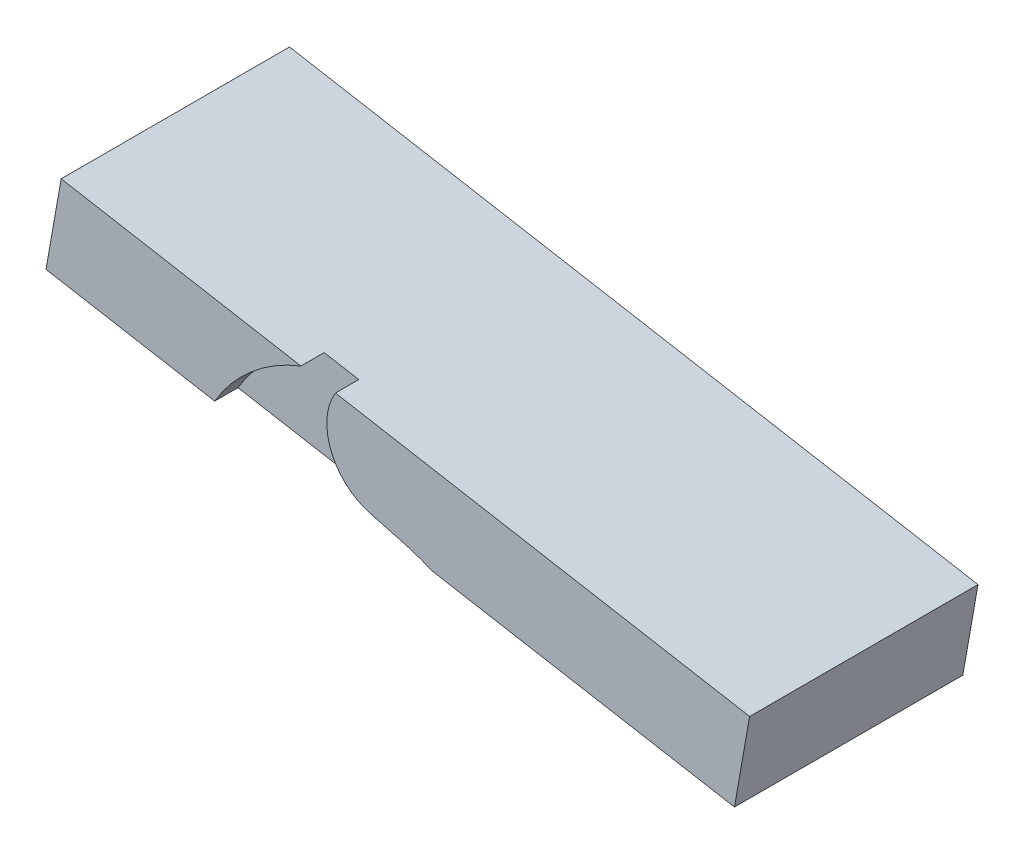
ISO-10303-21;
HEADER;
FILE_DESCRIPTION(('STEP AP214'),'2;1');
FILE_NAME('part.step','',(''),(''),'','','');
FILE_SCHEMA(('AUTOMOTIVE_DESIGN { 1 0 10303 214 1 1 1 1 }'));
ENDSEC;
DATA;
#1=APPLICATION_CONTEXT('core data for automotive mechanical design processes');
#2=APPLICATION_PROTOCOL_DEFINITION('international standard','automotive_design',2000,#1);
#3=PRODUCT_CONTEXT('',#1,'mechanical');
#4=PRODUCT('Part','Part','',(#3));
#5=PRODUCT_RELATED_PRODUCT_CATEGORY('part','',(#4));
#6=PRODUCT_DEFINITION_FORMATION('','',#4);
#7=PRODUCT_DEFINITION_CONTEXT('part definition',#1,'design');
#8=PRODUCT_DEFINITION('design','',#6,#7);
#9=PRODUCT_DEFINITION_SHAPE('','',#8);
#10=(LENGTH_UNIT() NAMED_UNIT(*) SI_UNIT(.MILLI.,.METRE.));
#11=(NAMED_UNIT(*) PLANE_ANGLE_UNIT() SI_UNIT($,.RADIAN.));
#12=(NAMED_UNIT(*) SI_UNIT($,.STERADIAN.) SOLID_ANGLE_UNIT());
#13=UNCERTAINTY_MEASURE_WITH_UNIT(LENGTH_MEASURE(1.E-05),#10,'distance_accuracy_value','');
#14=(GEOMETRIC_REPRESENTATION_CONTEXT(3) GLOBAL_UNCERTAINTY_ASSIGNED_CONTEXT((#13)) GLOBAL_UNIT_ASSIGNED_CONTEXT((#10,
#11,#12)) REPRESENTATION_CONTEXT('',''));
#15=CARTESIAN_POINT('',(0.,0.,0.));
#16=DIRECTION('',(0.,0.,1.));
#17=DIRECTION('',(1.,0.,0.));
#18=AXIS2_PLACEMENT_3D('',#15,#16,#17);
#19=CARTESIAN_POINT('',(0.,0.,-3.048));
#20=DIRECTION('',(0.,0.,1.));
#21=DIRECTION('',(1.,0.,0.));
#22=AXIS2_PLACEMENT_3D('',#19,#20,#21);
#23=PLANE('',#22);
#24=CARTESIAN_POINT('',(-2.48342826754325,-11.827752618226,-3.048));
#25=DIRECTION('',(0.,0.,1.));
#26=DIRECTION('',(1.,0.,0.));
#27=AXIS2_PLACEMENT_3D('',#24,#25,#26);
#28=CIRCLE('',#27,38.6647254004982);
#29=CARTESIAN_POINT('',(13.3811149594307,23.4323843425886,-3.048));
#30=VERTEX_POINT('',#29);
#31=CARTESIAN_POINT('',(7.52373903976478,25.5195042124902,-3.048));
#32=VERTEX_POINT('',#31);
#33=EDGE_CURVE('E213',#30,#32,#28,.T.);
#34=ORIENTED_EDGE('',*,*,#33,.T.);
#35=DIRECTION('',(0.965925826289069,-0.258819045102518,0.));
#36=VECTOR('',#35,1.);
#37=CARTESIAN_POINT('',(6.88387100306433,25.6909563361866,-3.048));
#38=LINE('',#37,#36);
#39=CARTESIAN_POINT('',(0.,27.5354840122576,-3.048));
#40=VERTEX_POINT('',#39);
#41=EDGE_CURVE('E211',#40,#32,#38,.T.);
#42=ORIENTED_EDGE('',*,*,#41,.F.);
#43=CARTESIAN_POINT('',(3.28700187280198,39.8027420061288,-3.048));
#44=DIRECTION('',(0.,0.,1.));
#45=DIRECTION('',(1.,0.,0.));
#46=AXIS2_PLACEMENT_3D('',#43,#44,#45);
#47=CIRCLE('',#46,12.7);
#48=CARTESIAN_POINT('',(-7.52655420820017,46.462847476992,-3.048));
#49=VERTEX_POINT('',#48);
#50=EDGE_CURVE('E208',#49,#40,#47,.T.);
#51=ORIENTED_EDGE('',*,*,#50,.F.);
#52=DIRECTION('',(0.984807753012207,-0.173648177666934,0.));
#53=VECTOR('',#52,1.);
#54=CARTESIAN_POINT('',(7.71866149729522,43.7747046213926,-3.048));
#55=LINE('',#54,#53);
#56=CARTESIAN_POINT('',(-15.0577360385898,47.7907980303111,-3.048));
#57=VERTEX_POINT('',#56);
#58=EDGE_CURVE('E183',#57,#49,#55,.T.);
#59=ORIENTED_EDGE('',*,*,#58,.F.);
#60=CARTESIAN_POINT('',(-1.24139416120389,12.5408173038956,-3.048));
#61=DIRECTION('',(0.,0.,1.));
#62=DIRECTION('',(1.,0.,0.));
#63=AXIS2_PLACEMENT_3D('',#60,#61,#62);
#64=CIRCLE('',#63,37.8609620068675);
#65=CARTESIAN_POINT('',(-33.8602061938296,31.7623038662221,-3.048));
#66=VERTEX_POINT('',#65);
#67=EDGE_CURVE('E41',#57,#66,#64,.T.);
#68=ORIENTED_EDGE('',*,*,#67,.T.);
#69=DIRECTION('',(-0.984807753012207,0.173648177666934,0.));
#70=VECTOR('',#69,1.);
#71=CARTESIAN_POINT('',(4.41066371274012,25.0141169265101,-3.048));
#72=LINE('',#71,#70);
#73=EDGE_CURVE('E188',#30,#66,#72,.T.);
#74=ORIENTED_EDGE('',*,*,#73,.F.);
#75=EDGE_LOOP('',(#34,#42,#51,#59,#68,#74));
#76=FACE_BOUND('',#75,.T.);
#77=ADVANCED_FACE('F37',(#76),#23,.T.);
#78=CARTESIAN_POINT('',(-2.48342826754325,-11.827752618226,3.048));
#79=DIRECTION('',(0.,0.,-1.));
#80=DIRECTION('',(-1.,0.,0.));
#81=AXIS2_PLACEMENT_3D('',#78,#79,#80);
#82=CYLINDRICAL_SURFACE('',#81,38.6647254004982);
#83=CARTESIAN_POINT('',(-2.48342826754325,-11.827752618226,2.032));
#84=DIRECTION('',(0.,0.,1.));
#85=DIRECTION('',(1.,0.,0.));
#86=AXIS2_PLACEMENT_3D('',#83,#84,#85);
#87=CIRCLE('',#86,38.6647254004982);
#88=CARTESIAN_POINT('',(13.3811149594308,23.4323843425886,2.032));
#89=VERTEX_POINT('',#88);
#90=CARTESIAN_POINT('',(7.52373903976478,25.5195042124902,2.032));
#91=VERTEX_POINT('',#90);
#92=EDGE_CURVE('E198',#89,#91,#87,.T.);
#93=ORIENTED_EDGE('',*,*,#92,.T.);
#94=DIRECTION('',(0.,0.,-1.));
#95=VECTOR('',#94,1.);
#96=CARTESIAN_POINT('',(7.52373903976478,25.5195042124902,3.048));
#97=LINE('',#96,#95);
#98=EDGE_CURVE('E202',#91,#32,#97,.T.);
#99=ORIENTED_EDGE('',*,*,#98,.T.);
#100=ORIENTED_EDGE('',*,*,#33,.F.);
#101=DIRECTION('',(0.,0.,-1.));
#102=VECTOR('',#101,1.);
#103=CARTESIAN_POINT('',(13.3811149594308,23.4323843425886,3.048));
#104=LINE('',#103,#102);
#105=EDGE_CURVE('E74',#89,#30,#104,.T.);
#106=ORIENTED_EDGE('',*,*,#105,.F.);
#107=EDGE_LOOP('',(#93,#99,#100,#106));
#108=FACE_BOUND('',#107,.T.);
#109=ADVANCED_FACE('F140',(#108),#82,.F.);
#110=CARTESIAN_POINT('',(-1.24139416120389,12.5408173038956,3.048));
#111=DIRECTION('',(0.,0.,-1.));
#112=DIRECTION('',(-1.,0.,0.));
#113=AXIS2_PLACEMENT_3D('',#110,#111,#112);
#114=CYLINDRICAL_SURFACE('',#113,37.8609620068675);
#115=ORIENTED_EDGE('',*,*,#67,.F.);
#116=DIRECTION('',(0.,0.,-1.));
#117=VECTOR('',#116,1.);
#118=CARTESIAN_POINT('',(-15.0577360385898,47.7907980303111,3.048));
#119=LINE('',#118,#117);
#120=CARTESIAN_POINT('',(-15.0577360385898,47.7907980303111,2.032));
#121=VERTEX_POINT('',#120);
#122=EDGE_CURVE('E230',#121,#57,#119,.T.);
#123=ORIENTED_EDGE('',*,*,#122,.F.);
#124=CARTESIAN_POINT('',(-1.24139416120389,12.5408173038956,2.032));
#125=DIRECTION('',(0.,0.,1.));
#126=DIRECTION('',(1.,0.,0.));
#127=AXIS2_PLACEMENT_3D('',#124,#125,#126);
#128=CIRCLE('',#127,37.8609620068675);
#129=CARTESIAN_POINT('',(-33.8602061938296,31.7623038662221,2.032));
#130=VERTEX_POINT('',#129);
#131=EDGE_CURVE('E194',#121,#130,#128,.T.);
#132=ORIENTED_EDGE('',*,*,#131,.T.);
#133=DIRECTION('',(0.,0.,-1.));
#134=VECTOR('',#133,1.);
#135=CARTESIAN_POINT('',(-33.8602061938296,31.7623038662221,3.048));
#136=LINE('',#135,#134);
#137=EDGE_CURVE('E197',#66,#130,#136,.F.);
#138=ORIENTED_EDGE('',*,*,#137,.F.);
#139=EDGE_LOOP('',(#115,#123,#132,#138));
#140=FACE_BOUND('',#139,.T.);
#141=ADVANCED_FACE('F146',(#140),#114,.F.);
#142=CARTESIAN_POINT('',(3.28700187280198,39.8027420061288,3.048));
#143=DIRECTION('',(0.,0.,-1.));
#144=DIRECTION('',(-1.,0.,0.));
#145=AXIS2_PLACEMENT_3D('',#142,#143,#144);
#146=CYLINDRICAL_SURFACE('',#145,12.7);
#147=DIRECTION('',(0.,0.,-1.));
#148=VECTOR('',#147,1.);
#149=CARTESIAN_POINT('',(-7.52655420820017,46.462847476992,3.048));
#150=LINE('',#149,#148);
#151=CARTESIAN_POINT('',(-7.52655420820017,46.462847476992,2.032));
#152=VERTEX_POINT('',#151);
#153=EDGE_CURVE('E200',#152,#49,#150,.T.);
#154=ORIENTED_EDGE('',*,*,#153,.T.);
#155=ORIENTED_EDGE('',*,*,#50,.T.);
#156=DIRECTION('',(0.,0.,-1.));
#157=VECTOR('',#156,1.);
#158=CARTESIAN_POINT('',(0.,27.5354840122576,3.048));
#159=LINE('',#158,#157);
#160=CARTESIAN_POINT('',(0.,27.5354840122576,2.032));
#161=VERTEX_POINT('',#160);
#162=EDGE_CURVE('E205',#161,#40,#159,.T.);
#163=ORIENTED_EDGE('',*,*,#162,.F.);
#164=CARTESIAN_POINT('',(3.28700187280198,39.8027420061288,2.032));
#165=DIRECTION('',(0.,0.,1.));
#166=DIRECTION('',(1.,0.,0.));
#167=AXIS2_PLACEMENT_3D('',#164,#165,#166);
#168=CIRCLE('',#167,12.7);
#169=EDGE_CURVE('E82',#152,#161,#168,.T.);
#170=ORIENTED_EDGE('',*,*,#169,.F.);
#171=EDGE_LOOP('',(#154,#155,#163,#170));
#172=FACE_BOUND('',#171,.T.);
#173=ADVANCED_FACE('F150',(#172),#146,.T.);
#174=CARTESIAN_POINT('',(6.88387100306433,25.6909563361866,3.048));
#175=DIRECTION('',(0.258819045102518,0.965925826289069,0.));
#176=DIRECTION('',(-0.965925826289069,0.258819045102518,0.));
#177=AXIS2_PLACEMENT_3D('',#174,#175,#176);
#178=PLANE('',#177);
#179=ORIENTED_EDGE('',*,*,#162,.T.);
#180=ORIENTED_EDGE('',*,*,#41,.T.);
#181=ORIENTED_EDGE('',*,*,#98,.F.);
#182=DIRECTION('',(0.965925826289069,-0.258819045102518,0.));
#183=VECTOR('',#182,1.);
#184=CARTESIAN_POINT('',(6.88387100306433,25.6909563361866,2.032));
#185=LINE('',#184,#183);
#186=EDGE_CURVE('E189',#161,#91,#185,.T.);
#187=ORIENTED_EDGE('',*,*,#186,.F.);
#188=EDGE_LOOP('',(#179,#180,#181,#187));
#189=FACE_BOUND('',#188,.T.);
#190=ADVANCED_FACE('F153',(#189),#178,.F.);
#191=CARTESIAN_POINT('',(-70.6316870667901,38.2461080647304,162.968548839141));
#192=DIRECTION('',(0.984807753012207,-0.173648177666934,0.));
#193=DIRECTION('',(0.173648177666934,0.984807753012207,0.));
#194=AXIS2_PLACEMENT_3D('',#191,#192,#193);
#195=PLANE('',#194);
#196=DIRECTION('',(-0.173648177666934,-0.984807753012207,0.));
#197=VECTOR('',#196,1.);
#198=CARTESIAN_POINT('',(-70.6316870667901,38.2461080647304,2.03200000000001));
#199=LINE('',#198,#197);
#200=CARTESIAN_POINT('',(-67.323689282235,57.006695759613,2.03200000000001));
#201=VERTEX_POINT('',#200);
#202=CARTESIAN_POINT('',(-70.6316870667901,38.2461080647304,2.03200000000001));
#203=VERTEX_POINT('',#202);
#204=EDGE_CURVE('E171',#201,#203,#199,.T.);
#205=ORIENTED_EDGE('',*,*,#204,.F.);
#206=DIRECTION('',(0.,0.,-1.));
#207=VECTOR('',#206,1.);
#208=CARTESIAN_POINT('',(-67.323689282235,57.006695759613,162.968548839141));
#209=LINE('',#208,#207);
#210=CARTESIAN_POINT('',(-67.323689282235,57.006695759613,-47.752));
#211=VERTEX_POINT('',#210);
#212=EDGE_CURVE('E172',#201,#211,#209,.T.);
#213=ORIENTED_EDGE('',*,*,#212,.T.);
#214=DIRECTION('',(0.173648177666934,0.984807753012207,0.));
#215=VECTOR('',#214,1.);
#216=CARTESIAN_POINT('',(-70.6316870667901,38.2461080647304,-47.752));
#217=LINE('',#216,#215);
#218=CARTESIAN_POINT('',(-70.6316870667901,38.2461080647304,-47.752));
#219=VERTEX_POINT('',#218);
#220=EDGE_CURVE('E122',#219,#211,#217,.T.);
#221=ORIENTED_EDGE('',*,*,#220,.F.);
#222=DIRECTION('',(0.,0.,-1.));
#223=VECTOR('',#222,1.);
#224=CARTESIAN_POINT('',(-70.6316870667901,38.2461080647304,162.968548839141));
#225=LINE('',#224,#223);
#226=EDGE_CURVE('E173',#203,#219,#225,.T.);
#227=ORIENTED_EDGE('',*,*,#226,.F.);
#228=EDGE_LOOP('',(#205,#213,#221,#227));
#229=FACE_BOUND('',#228,.T.);
#230=ADVANCED_FACE('F136',(#229),#195,.F.);
#231=CARTESIAN_POINT('',(0.,0.,-47.752));
#232=DIRECTION('',(0.,0.,1.));
#233=DIRECTION('',(1.,0.,0.));
#234=AXIS2_PLACEMENT_3D('',#231,#232,#233);
#235=PLANE('',#234);
#236=ORIENTED_EDGE('',*,*,#220,.T.);
#237=DIRECTION('',(0.984807753012207,-0.173648177666934,0.));
#238=VECTOR('',#237,1.);
#239=CARTESIAN_POINT('',(-67.323689282235,57.006695759613,-47.752));
#240=LINE('',#239,#238);
#241=CARTESIAN_POINT('',(82.7610122768254,30.5427134831723,-47.752));
#242=VERTEX_POINT('',#241);
#243=EDGE_CURVE('E47',#211,#242,#240,.T.);
#244=ORIENTED_EDGE('',*,*,#243,.T.);
#245=DIRECTION('',(-0.173648177666933,-0.984807753012208,0.));
#246=VECTOR('',#245,1.);
#247=CARTESIAN_POINT('',(79.4530144922704,11.7821257882897,-47.752));
#248=LINE('',#247,#246);
#249=CARTESIAN_POINT('',(79.4530144922704,11.7821257882897,-47.752));
#250=VERTEX_POINT('',#249);
#251=EDGE_CURVE('E11',#242,#250,#248,.T.);
#252=ORIENTED_EDGE('',*,*,#251,.T.);
#253=DIRECTION('',(-0.984807753012207,0.173648177666934,0.));
#254=VECTOR('',#253,1.);
#255=CARTESIAN_POINT('',(-70.6316870667901,38.2461080647304,-47.752));
#256=LINE('',#255,#254);
#257=EDGE_CURVE('E184',#250,#219,#256,.T.);
#258=ORIENTED_EDGE('',*,*,#257,.T.);
#259=EDGE_LOOP('',(#236,#244,#252,#258));
#260=FACE_BOUND('',#259,.T.);
#261=ADVANCED_FACE('F118',(#260),#235,.F.);
#262=CARTESIAN_POINT('',(79.4530144922704,11.7821257882897,162.968548839141));
#263=DIRECTION('',(-0.984807753012208,0.173648177666933,0.));
#264=DIRECTION('',(-0.173648177666933,-0.984807753012208,0.));
#265=AXIS2_PLACEMENT_3D('',#262,#263,#264);
#266=PLANE('',#265);
#267=DIRECTION('',(0.173648177666933,0.984807753012208,0.));
#268=VECTOR('',#267,1.);
#269=CARTESIAN_POINT('',(79.4530144922704,11.7821257882897,2.03200000000001));
#270=LINE('',#269,#268);
#271=CARTESIAN_POINT('',(79.4530144922704,11.7821257882897,2.03200000000001));
#272=VERTEX_POINT('',#271);
#273=CARTESIAN_POINT('',(82.7610122768254,30.5427134831723,2.03200000000001));
#274=VERTEX_POINT('',#273);
#275=EDGE_CURVE('E125',#272,#274,#270,.T.);
#276=ORIENTED_EDGE('',*,*,#275,.F.);
#277=DIRECTION('',(0.,0.,-1.));
#278=VECTOR('',#277,1.);
#279=CARTESIAN_POINT('',(79.4530144922704,11.7821257882897,162.968548839141));
#280=LINE('',#279,#278);
#281=EDGE_CURVE('E56',#272,#250,#280,.T.);
#282=ORIENTED_EDGE('',*,*,#281,.T.);
#283=ORIENTED_EDGE('',*,*,#251,.F.);
#284=DIRECTION('',(0.,0.,-1.));
#285=VECTOR('',#284,1.);
#286=CARTESIAN_POINT('',(82.7610122768254,30.5427134831723,162.968548839141));
#287=LINE('',#286,#285);
#288=EDGE_CURVE('E109',#274,#242,#287,.T.);
#289=ORIENTED_EDGE('',*,*,#288,.F.);
#290=EDGE_LOOP('',(#276,#282,#283,#289));
#291=FACE_BOUND('',#290,.T.);
#292=ADVANCED_FACE('F124',(#291),#266,.F.);
#293=CARTESIAN_POINT('',(0.,0.,2.032));
#294=DIRECTION('',(0.,0.,1.));
#295=DIRECTION('',(1.,0.,0.));
#296=AXIS2_PLACEMENT_3D('',#293,#294,#295);
#297=PLANE('',#296);
#298=ORIENTED_EDGE('',*,*,#92,.F.);
#299=DIRECTION('',(0.984807753012207,-0.173648177666934,0.));
#300=VECTOR('',#299,1.);
#301=CARTESIAN_POINT('',(-70.6316870667901,38.2461080647304,2.03200000000001));
#302=LINE('',#301,#300);
#303=EDGE_CURVE('E175',#89,#272,#302,.T.);
#304=ORIENTED_EDGE('',*,*,#303,.T.);
#305=ORIENTED_EDGE('',*,*,#275,.T.);
#306=DIRECTION('',(-0.984807753012207,0.173648177666934,0.));
#307=VECTOR('',#306,1.);
#308=CARTESIAN_POINT('',(-67.323689282235,57.006695759613,2.03200000000001));
#309=LINE('',#308,#307);
#310=EDGE_CURVE('E113',#274,#152,#309,.T.);
#311=ORIENTED_EDGE('',*,*,#310,.T.);
#312=ORIENTED_EDGE('',*,*,#169,.T.);
#313=ORIENTED_EDGE('',*,*,#186,.T.);
#314=EDGE_LOOP('',(#298,#304,#305,#311,#312,#313));
#315=FACE_BOUND('',#314,.T.);
#316=ADVANCED_FACE('F127',(#315),#297,.T.);
#317=ORIENTED_EDGE('',*,*,#131,.F.);
#318=EDGE_CURVE('E90',#121,#201,#309,.T.);
#319=ORIENTED_EDGE('',*,*,#318,.T.);
#320=ORIENTED_EDGE('',*,*,#204,.T.);
#321=EDGE_CURVE('E178',#203,#130,#302,.T.);
#322=ORIENTED_EDGE('',*,*,#321,.T.);
#323=EDGE_LOOP('',(#317,#319,#320,#322));
#324=FACE_BOUND('',#323,.T.);
#325=ADVANCED_FACE('F133',(#324),#297,.T.);
#326=CARTESIAN_POINT('',(-67.323689282235,57.006695759613,162.968548839141));
#327=DIRECTION('',(-0.173648177666934,-0.984807753012207,0.));
#328=DIRECTION('',(0.984807753012207,-0.173648177666934,0.));
#329=AXIS2_PLACEMENT_3D('',#326,#327,#328);
#330=PLANE('',#329);
#331=ORIENTED_EDGE('',*,*,#318,.F.);
#332=ORIENTED_EDGE('',*,*,#122,.T.);
#333=ORIENTED_EDGE('',*,*,#58,.T.);
#334=ORIENTED_EDGE('',*,*,#153,.F.);
#335=ORIENTED_EDGE('',*,*,#310,.F.);
#336=ORIENTED_EDGE('',*,*,#288,.T.);
#337=ORIENTED_EDGE('',*,*,#243,.F.);
#338=ORIENTED_EDGE('',*,*,#212,.F.);
#339=EDGE_LOOP('',(#331,#332,#333,#334,#335,#336,#337,#338));
#340=FACE_BOUND('',#339,.T.);
#341=ADVANCED_FACE('F111',(#340),#330,.F.);
#342=CARTESIAN_POINT('',(-70.6316870667901,38.2461080647304,162.968548839141));
#343=DIRECTION('',(0.173648177666934,0.984807753012207,0.));
#344=DIRECTION('',(-0.984807753012207,0.173648177666934,0.));
#345=AXIS2_PLACEMENT_3D('',#342,#343,#344);
#346=PLANE('',#345);
#347=ORIENTED_EDGE('',*,*,#73,.T.);
#348=ORIENTED_EDGE('',*,*,#137,.T.);
#349=ORIENTED_EDGE('',*,*,#321,.F.);
#350=ORIENTED_EDGE('',*,*,#226,.T.);
#351=ORIENTED_EDGE('',*,*,#257,.F.);
#352=ORIENTED_EDGE('',*,*,#281,.F.);
#353=ORIENTED_EDGE('',*,*,#303,.F.);
#354=ORIENTED_EDGE('',*,*,#105,.T.);
#355=EDGE_LOOP('',(#347,#348,#349,#350,#351,#352,#353,#354));
#356=FACE_BOUND('',#355,.T.);
#357=ADVANCED_FACE('F39',(#356),#346,.F.);
#358=CLOSED_SHELL('',(#77,#109,#141,#173,#190,#230,#261,#292,#316,#325,#341,#357));
#359=MANIFOLD_SOLID_BREP('B2',#358);
#360=ADVANCED_BREP_SHAPE_REPRESENTATION('',(#18,#359),#14);
#361=SHAPE_DEFINITION_REPRESENTATION(#9,#360);
ENDSEC;
END-ISO-10303-21;
